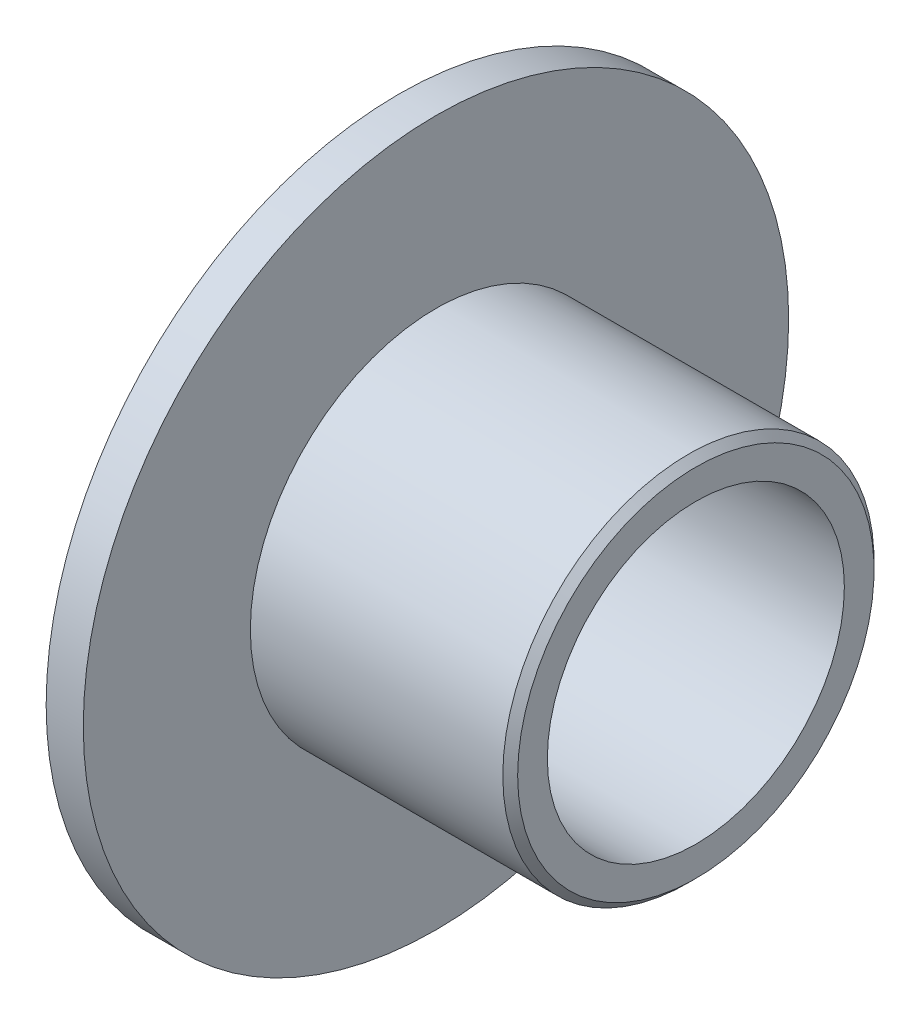
ISO-10303-21;
HEADER;
FILE_DESCRIPTION(('STEP AP214'),'2;1');
FILE_NAME('part.step','',(''),(''),'','','');
FILE_SCHEMA(('AUTOMOTIVE_DESIGN { 1 0 10303 214 1 1 1 1 }'));
ENDSEC;
DATA;
#1=APPLICATION_CONTEXT('core data for automotive mechanical design processes');
#2=APPLICATION_PROTOCOL_DEFINITION('international standard','automotive_design',2000,#1);
#3=PRODUCT_CONTEXT('',#1,'mechanical');
#4=PRODUCT('Part','Part','',(#3));
#5=PRODUCT_RELATED_PRODUCT_CATEGORY('part','',(#4));
#6=PRODUCT_DEFINITION_FORMATION('','',#4);
#7=PRODUCT_DEFINITION_CONTEXT('part definition',#1,'design');
#8=PRODUCT_DEFINITION('design','',#6,#7);
#9=PRODUCT_DEFINITION_SHAPE('','',#8);
#10=(LENGTH_UNIT() NAMED_UNIT(*) SI_UNIT(.MILLI.,.METRE.));
#11=(NAMED_UNIT(*) PLANE_ANGLE_UNIT() SI_UNIT($,.RADIAN.));
#12=(NAMED_UNIT(*) SI_UNIT($,.STERADIAN.) SOLID_ANGLE_UNIT());
#13=UNCERTAINTY_MEASURE_WITH_UNIT(LENGTH_MEASURE(1.E-05),#10,'distance_accuracy_value','');
#14=(GEOMETRIC_REPRESENTATION_CONTEXT(3) GLOBAL_UNCERTAINTY_ASSIGNED_CONTEXT((#13)) GLOBAL_UNIT_ASSIGNED_CONTEXT((#10,
#11,#12)) REPRESENTATION_CONTEXT('',''));
#15=CARTESIAN_POINT('',(0.,0.,0.));
#16=DIRECTION('',(0.,0.,1.));
#17=DIRECTION('',(1.,0.,0.));
#18=AXIS2_PLACEMENT_3D('',#15,#16,#17);
#19=CARTESIAN_POINT('',(0.,0.,0.));
#20=DIRECTION('',(-1.,0.,0.));
#21=DIRECTION('',(0.,0.,1.));
#22=AXIS2_PLACEMENT_3D('',#19,#20,#21);
#23=CYLINDRICAL_SURFACE('',#22,4.75);
#24=CARTESIAN_POINT('',(0.,0.,0.));
#25=DIRECTION('',(-1.,0.,0.));
#26=DIRECTION('',(0.,0.,1.));
#27=AXIS2_PLACEMENT_3D('',#24,#25,#26);
#28=CIRCLE('',#27,4.75);
#29=CARTESIAN_POINT('',(0.,0.,4.75));
#30=VERTEX_POINT('',#29);
#31=EDGE_CURVE('E24',#30,#30,#28,.T.);
#32=ORIENTED_EDGE('',*,*,#31,.F.);
#33=EDGE_LOOP('',(#32));
#34=FACE_BOUND('',#33,.T.);
#35=CARTESIAN_POINT('',(0.5,0.,0.));
#36=DIRECTION('',(-1.,0.,0.));
#37=DIRECTION('',(0.,0.,1.));
#38=AXIS2_PLACEMENT_3D('',#35,#36,#37);
#39=CIRCLE('',#38,4.75);
#40=CARTESIAN_POINT('',(0.5,0.,4.75));
#41=VERTEX_POINT('',#40);
#42=EDGE_CURVE('E39',#41,#41,#39,.T.);
#43=ORIENTED_EDGE('',*,*,#42,.T.);
#44=EDGE_LOOP('',(#43));
#45=FACE_BOUND('',#44,.T.);
#46=ADVANCED_FACE('F13',(#34,#45),#23,.T.);
#47=CARTESIAN_POINT('',(0.,4.75,0.));
#48=DIRECTION('',(1.,0.,0.));
#49=DIRECTION('',(0.,0.,-1.));
#50=AXIS2_PLACEMENT_3D('',#47,#48,#49);
#51=PLANE('',#50);
#52=CARTESIAN_POINT('',(0.,0.,0.));
#53=DIRECTION('',(-1.,0.,0.));
#54=DIRECTION('',(0.,0.,1.));
#55=AXIS2_PLACEMENT_3D('',#52,#53,#54);
#56=CIRCLE('',#55,2.);
#57=CARTESIAN_POINT('',(0.,0.,2.));
#58=VERTEX_POINT('',#57);
#59=EDGE_CURVE('E28',#58,#58,#56,.T.);
#60=ORIENTED_EDGE('',*,*,#59,.F.);
#61=EDGE_LOOP('',(#60));
#62=FACE_BOUND('',#61,.T.);
#63=ORIENTED_EDGE('',*,*,#31,.T.);
#64=EDGE_LOOP('',(#63));
#65=FACE_BOUND('',#64,.T.);
#66=ADVANCED_FACE('F61',(#62,#65),#51,.F.);
#67=CARTESIAN_POINT('',(0.,0.,0.));
#68=DIRECTION('',(-1.,0.,0.));
#69=DIRECTION('',(0.,0.,1.));
#70=AXIS2_PLACEMENT_3D('',#67,#68,#69);
#71=CYLINDRICAL_SURFACE('',#70,2.);
#72=CARTESIAN_POINT('',(4.,0.,0.));
#73=DIRECTION('',(-1.,0.,0.));
#74=DIRECTION('',(0.,0.,1.));
#75=AXIS2_PLACEMENT_3D('',#72,#73,#74);
#76=CIRCLE('',#75,2.);
#77=CARTESIAN_POINT('',(4.,0.,2.));
#78=VERTEX_POINT('',#77);
#79=EDGE_CURVE('E33',#78,#78,#76,.T.);
#80=ORIENTED_EDGE('',*,*,#79,.F.);
#81=EDGE_LOOP('',(#80));
#82=FACE_BOUND('',#81,.T.);
#83=ORIENTED_EDGE('',*,*,#59,.T.);
#84=EDGE_LOOP('',(#83));
#85=FACE_BOUND('',#84,.T.);
#86=ADVANCED_FACE('F58',(#82,#85),#71,.F.);
#87=CARTESIAN_POINT('',(4.,2.,0.));
#88=DIRECTION('',(-1.,0.,0.));
#89=DIRECTION('',(0.,0.,1.));
#90=AXIS2_PLACEMENT_3D('',#87,#88,#89);
#91=PLANE('',#90);
#92=CARTESIAN_POINT('',(4.,0.,0.));
#93=DIRECTION('',(-1.,0.,0.));
#94=DIRECTION('',(0.,0.,1.));
#95=AXIS2_PLACEMENT_3D('',#92,#93,#94);
#96=CIRCLE('',#95,2.4);
#97=CARTESIAN_POINT('',(4.,0.,2.4));
#98=VERTEX_POINT('',#97);
#99=EDGE_CURVE('E9',#98,#98,#96,.F.);
#100=ORIENTED_EDGE('',*,*,#99,.T.);
#101=EDGE_LOOP('',(#100));
#102=FACE_BOUND('',#101,.T.);
#103=ORIENTED_EDGE('',*,*,#79,.T.);
#104=EDGE_LOOP('',(#103));
#105=FACE_BOUND('',#104,.T.);
#106=ADVANCED_FACE('F52',(#102,#105),#91,.F.);
#107=CARTESIAN_POINT('',(0.,0.,0.));
#108=DIRECTION('',(-1.,0.,0.));
#109=DIRECTION('',(0.,0.,1.));
#110=AXIS2_PLACEMENT_3D('',#107,#108,#109);
#111=CYLINDRICAL_SURFACE('',#110,2.5);
#112=CARTESIAN_POINT('',(3.9,0.,0.));
#113=DIRECTION('',(-1.,0.,0.));
#114=DIRECTION('',(0.,0.,1.));
#115=AXIS2_PLACEMENT_3D('',#112,#113,#114);
#116=CIRCLE('',#115,2.5);
#117=CARTESIAN_POINT('',(3.9,0.,2.5));
#118=VERTEX_POINT('',#117);
#119=EDGE_CURVE('E20',#118,#118,#116,.T.);
#120=ORIENTED_EDGE('',*,*,#119,.T.);
#121=EDGE_LOOP('',(#120));
#122=FACE_BOUND('',#121,.T.);
#123=CARTESIAN_POINT('',(0.5,0.,0.));
#124=DIRECTION('',(-1.,0.,0.));
#125=DIRECTION('',(0.,0.,1.));
#126=AXIS2_PLACEMENT_3D('',#123,#124,#125);
#127=CIRCLE('',#126,2.5);
#128=CARTESIAN_POINT('',(0.5,0.,2.5));
#129=VERTEX_POINT('',#128);
#130=EDGE_CURVE('E36',#129,#129,#127,.T.);
#131=ORIENTED_EDGE('',*,*,#130,.F.);
#132=EDGE_LOOP('',(#131));
#133=FACE_BOUND('',#132,.T.);
#134=ADVANCED_FACE('F47',(#122,#133),#111,.T.);
#135=CARTESIAN_POINT('',(0.5,2.5,0.));
#136=DIRECTION('',(-1.,0.,0.));
#137=DIRECTION('',(0.,0.,1.));
#138=AXIS2_PLACEMENT_3D('',#135,#136,#137);
#139=PLANE('',#138);
#140=ORIENTED_EDGE('',*,*,#42,.F.);
#141=EDGE_LOOP('',(#140));
#142=FACE_BOUND('',#141,.T.);
#143=ORIENTED_EDGE('',*,*,#130,.T.);
#144=EDGE_LOOP('',(#143));
#145=FACE_BOUND('',#144,.T.);
#146=ADVANCED_FACE('F44',(#142,#145),#139,.F.);
#147=CARTESIAN_POINT('',(3.9,0.,0.));
#148=DIRECTION('',(-1.,0.,0.));
#149=DIRECTION('',(0.,0.,1.));
#150=AXIS2_PLACEMENT_3D('',#147,#148,#149);
#151=CONICAL_SURFACE('',#150,2.5,0.785398163397448);
#152=ORIENTED_EDGE('',*,*,#99,.F.);
#153=EDGE_LOOP('',(#152));
#154=FACE_BOUND('',#153,.T.);
#155=ORIENTED_EDGE('',*,*,#119,.F.);
#156=EDGE_LOOP('',(#155));
#157=FACE_BOUND('',#156,.T.);
#158=ADVANCED_FACE('F15',(#154,#157),#151,.T.);
#159=CLOSED_SHELL('',(#46,#66,#86,#106,#134,#146,#158));
#160=MANIFOLD_SOLID_BREP('B1',#159);
#161=ADVANCED_BREP_SHAPE_REPRESENTATION('',(#18,#160),#14);
#162=SHAPE_DEFINITION_REPRESENTATION(#9,#161);
ENDSEC;
END-ISO-10303-21;
